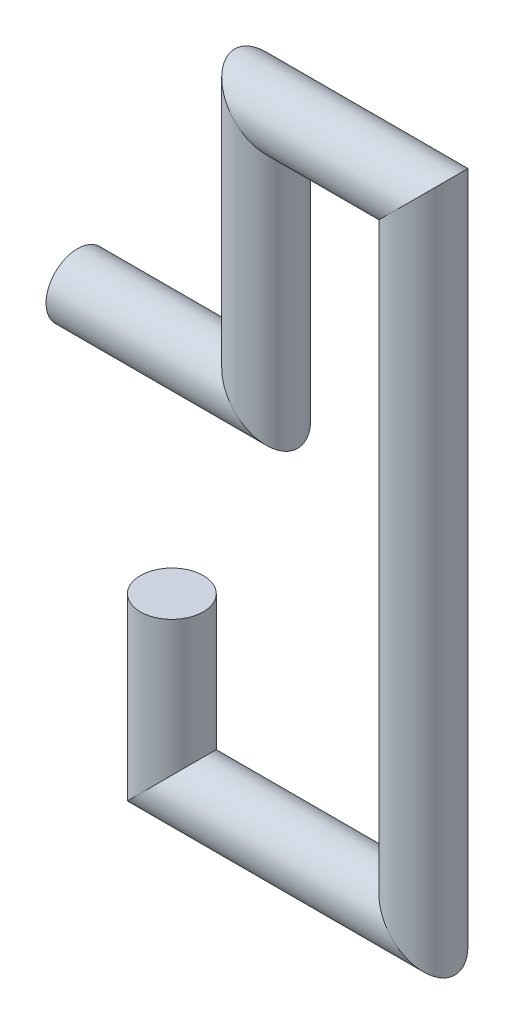
ISO-10303-21;
HEADER;
FILE_DESCRIPTION(('STEP AP214'),'2;1');
FILE_NAME('part.step','',(''),(''),'','','');
FILE_SCHEMA(('AUTOMOTIVE_DESIGN { 1 0 10303 214 1 1 1 1 }'));
ENDSEC;
DATA;
#1=APPLICATION_CONTEXT('core data for automotive mechanical design processes');
#2=APPLICATION_PROTOCOL_DEFINITION('international standard','automotive_design',2000,#1);
#3=PRODUCT_CONTEXT('',#1,'mechanical');
#4=PRODUCT('Part','Part','',(#3));
#5=PRODUCT_RELATED_PRODUCT_CATEGORY('part','',(#4));
#6=PRODUCT_DEFINITION_FORMATION('','',#4);
#7=PRODUCT_DEFINITION_CONTEXT('part definition',#1,'design');
#8=PRODUCT_DEFINITION('design','',#6,#7);
#9=PRODUCT_DEFINITION_SHAPE('','',#8);
#10=(LENGTH_UNIT() NAMED_UNIT(*) SI_UNIT(.MILLI.,.METRE.));
#11=(NAMED_UNIT(*) PLANE_ANGLE_UNIT() SI_UNIT($,.RADIAN.));
#12=(NAMED_UNIT(*) SI_UNIT($,.STERADIAN.) SOLID_ANGLE_UNIT());
#13=UNCERTAINTY_MEASURE_WITH_UNIT(LENGTH_MEASURE(1.E-05),#10,'distance_accuracy_value','');
#14=(GEOMETRIC_REPRESENTATION_CONTEXT(3) GLOBAL_UNCERTAINTY_ASSIGNED_CONTEXT((#13)) GLOBAL_UNIT_ASSIGNED_CONTEXT((#10,
#11,#12)) REPRESENTATION_CONTEXT('',''));
#15=CARTESIAN_POINT('',(0.,0.,0.));
#16=DIRECTION('',(0.,0.,1.));
#17=DIRECTION('',(1.,0.,0.));
#18=AXIS2_PLACEMENT_3D('',#15,#16,#17);
#19=CARTESIAN_POINT('',(30.,-120.,0.));
#20=DIRECTION('',(0.,1.,0.));
#21=DIRECTION('',(0.,0.,1.));
#22=AXIS2_PLACEMENT_3D('',#19,#20,#21);
#23=CYLINDRICAL_SURFACE('',#22,10.);
#24=CARTESIAN_POINT('',(30.,-120.,0.));
#25=DIRECTION('',(-0.707106781186548,0.707106781186548,0.));
#26=DIRECTION('',(-0.707106781186548,-0.707106781186548,0.));
#27=AXIS2_PLACEMENT_3D('',#24,#25,#26);
#28=ELLIPSE('',#27,14.1421356237309,10.);
#29=CARTESIAN_POINT('',(20.,-130.,0.));
#30=VERTEX_POINT('',#29);
#31=EDGE_CURVE('E42',#30,#30,#28,.T.);
#32=ORIENTED_EDGE('',*,*,#31,.T.);
#33=EDGE_LOOP('',(#32));
#34=FACE_BOUND('',#33,.T.);
#35=CARTESIAN_POINT('',(30.,-70.,0.));
#36=DIRECTION('',(0.,1.,0.));
#37=DIRECTION('',(0.,0.,1.));
#38=AXIS2_PLACEMENT_3D('',#35,#36,#37);
#39=CIRCLE('',#38,10.);
#40=CARTESIAN_POINT('',(30.,-70.,10.));
#41=VERTEX_POINT('',#40);
#42=EDGE_CURVE('E11',#41,#41,#39,.F.);
#43=ORIENTED_EDGE('',*,*,#42,.T.);
#44=EDGE_LOOP('',(#43));
#45=FACE_BOUND('',#44,.T.);
#46=ADVANCED_FACE('F36',(#34,#45),#23,.T.);
#47=CARTESIAN_POINT('',(110.,-120.,0.));
#48=DIRECTION('',(-1.,0.,0.));
#49=DIRECTION('',(0.,0.,1.));
#50=AXIS2_PLACEMENT_3D('',#47,#48,#49);
#51=CYLINDRICAL_SURFACE('',#50,10.);
#52=CARTESIAN_POINT('',(110.,-120.,0.));
#53=DIRECTION('',(-0.707106781186547,-0.707106781186548,0.));
#54=DIRECTION('',(0.707106781186548,-0.707106781186547,0.));
#55=AXIS2_PLACEMENT_3D('',#52,#53,#54);
#56=ELLIPSE('',#55,14.1421356237309,10.);
#57=CARTESIAN_POINT('',(120.,-130.,0.));
#58=VERTEX_POINT('',#57);
#59=EDGE_CURVE('E46',#58,#58,#56,.F.);
#60=ORIENTED_EDGE('',*,*,#59,.F.);
#61=EDGE_LOOP('',(#60));
#62=FACE_BOUND('',#61,.T.);
#63=ORIENTED_EDGE('',*,*,#31,.F.);
#64=EDGE_LOOP('',(#63));
#65=FACE_BOUND('',#64,.T.);
#66=ADVANCED_FACE('F81',(#62,#65),#51,.T.);
#67=CARTESIAN_POINT('',(110.,80.,0.));
#68=DIRECTION('',(0.,-1.,0.));
#69=DIRECTION('',(1.,0.,0.));
#70=AXIS2_PLACEMENT_3D('',#67,#68,#69);
#71=CYLINDRICAL_SURFACE('',#70,10.);
#72=CARTESIAN_POINT('',(110.,80.,0.));
#73=DIRECTION('',(0.707106781186548,-0.707106781186547,0.));
#74=DIRECTION('',(0.707106781186547,0.707106781186548,0.));
#75=AXIS2_PLACEMENT_3D('',#72,#73,#74);
#76=ELLIPSE('',#75,14.1421356237309,10.);
#77=CARTESIAN_POINT('',(120.,90.,0.));
#78=VERTEX_POINT('',#77);
#79=EDGE_CURVE('E50',#78,#78,#76,.T.);
#80=ORIENTED_EDGE('',*,*,#79,.T.);
#81=EDGE_LOOP('',(#80));
#82=FACE_BOUND('',#81,.T.);
#83=ORIENTED_EDGE('',*,*,#59,.T.);
#84=EDGE_LOOP('',(#83));
#85=FACE_BOUND('',#84,.T.);
#86=ADVANCED_FACE('F85',(#82,#85),#71,.T.);
#87=CARTESIAN_POINT('',(60.,80.,0.));
#88=DIRECTION('',(1.,0.,0.));
#89=DIRECTION('',(0.,0.,-1.));
#90=AXIS2_PLACEMENT_3D('',#87,#88,#89);
#91=CYLINDRICAL_SURFACE('',#90,10.);
#92=CARTESIAN_POINT('',(60.,80.,0.));
#93=DIRECTION('',(0.707106781186548,0.707106781186548,0.));
#94=DIRECTION('',(-0.707106781186548,0.707106781186548,0.));
#95=AXIS2_PLACEMENT_3D('',#92,#93,#94);
#96=ELLIPSE('',#95,14.1421356237309,10.);
#97=CARTESIAN_POINT('',(50.,90.,0.));
#98=VERTEX_POINT('',#97);
#99=EDGE_CURVE('E55',#98,#98,#96,.F.);
#100=ORIENTED_EDGE('',*,*,#99,.F.);
#101=EDGE_LOOP('',(#100));
#102=FACE_BOUND('',#101,.T.);
#103=ORIENTED_EDGE('',*,*,#79,.F.);
#104=EDGE_LOOP('',(#103));
#105=FACE_BOUND('',#104,.T.);
#106=ADVANCED_FACE('F90',(#102,#105),#91,.T.);
#107=CARTESIAN_POINT('',(60.,0.,0.));
#108=DIRECTION('',(0.,1.,0.));
#109=DIRECTION('',(0.,0.,1.));
#110=AXIS2_PLACEMENT_3D('',#107,#108,#109);
#111=CYLINDRICAL_SURFACE('',#110,10.);
#112=CARTESIAN_POINT('',(60.,0.,0.));
#113=DIRECTION('',(0.707106781186548,0.707106781186548,0.));
#114=DIRECTION('',(-0.707106781186548,0.707106781186548,0.));
#115=AXIS2_PLACEMENT_3D('',#112,#113,#114);
#116=ELLIPSE('',#115,14.1421356237309,10.);
#117=CARTESIAN_POINT('',(50.,10.,0.));
#118=VERTEX_POINT('',#117);
#119=EDGE_CURVE('E58',#118,#118,#116,.T.);
#120=ORIENTED_EDGE('',*,*,#119,.T.);
#121=EDGE_LOOP('',(#120));
#122=FACE_BOUND('',#121,.T.);
#123=ORIENTED_EDGE('',*,*,#99,.T.);
#124=EDGE_LOOP('',(#123));
#125=FACE_BOUND('',#124,.T.);
#126=ADVANCED_FACE('F78',(#122,#125),#111,.T.);
#127=CARTESIAN_POINT('',(88.2842712474619,0.,0.));
#128=DIRECTION('',(-1.,0.,0.));
#129=DIRECTION('',(0.,0.,1.));
#130=AXIS2_PLACEMENT_3D('',#127,#128,#129);
#131=CYLINDRICAL_SURFACE('',#130,10.);
#132=CARTESIAN_POINT('',(0.,0.,0.));
#133=DIRECTION('',(1.,0.,0.));
#134=DIRECTION('',(0.,0.,-1.));
#135=AXIS2_PLACEMENT_3D('',#132,#133,#134);
#136=CIRCLE('',#135,10.);
#137=CARTESIAN_POINT('',(0.,0.,-10.));
#138=VERTEX_POINT('',#137);
#139=EDGE_CURVE('E61',#138,#138,#136,.T.);
#140=ORIENTED_EDGE('',*,*,#139,.T.);
#141=EDGE_LOOP('',(#140));
#142=FACE_BOUND('',#141,.T.);
#143=ORIENTED_EDGE('',*,*,#119,.F.);
#144=EDGE_LOOP('',(#143));
#145=FACE_BOUND('',#144,.T.);
#146=ADVANCED_FACE('F65',(#142,#145),#131,.T.);
#147=CARTESIAN_POINT('',(0.,0.,0.));
#148=DIRECTION('',(1.,0.,0.));
#149=DIRECTION('',(0.,0.,-1.));
#150=AXIS2_PLACEMENT_3D('',#147,#148,#149);
#151=PLANE('',#150);
#152=ORIENTED_EDGE('',*,*,#139,.F.);
#153=EDGE_LOOP('',(#152));
#154=FACE_BOUND('',#153,.T.);
#155=ADVANCED_FACE('F68',(#154),#151,.F.);
#156=CARTESIAN_POINT('',(30.,-70.,0.));
#157=DIRECTION('',(0.,1.,0.));
#158=DIRECTION('',(0.,0.,1.));
#159=AXIS2_PLACEMENT_3D('',#156,#157,#158);
#160=PLANE('',#159);
#161=ORIENTED_EDGE('',*,*,#42,.F.);
#162=EDGE_LOOP('',(#161));
#163=FACE_BOUND('',#162,.T.);
#164=ADVANCED_FACE('F70',(#163),#160,.T.);
#165=CLOSED_SHELL('',(#46,#66,#86,#106,#126,#146,#155,#164));
#166=MANIFOLD_SOLID_BREP('B2',#165);
#167=ADVANCED_BREP_SHAPE_REPRESENTATION('',(#18,#166),#14);
#168=SHAPE_DEFINITION_REPRESENTATION(#9,#167);
ENDSEC;
END-ISO-10303-21;
